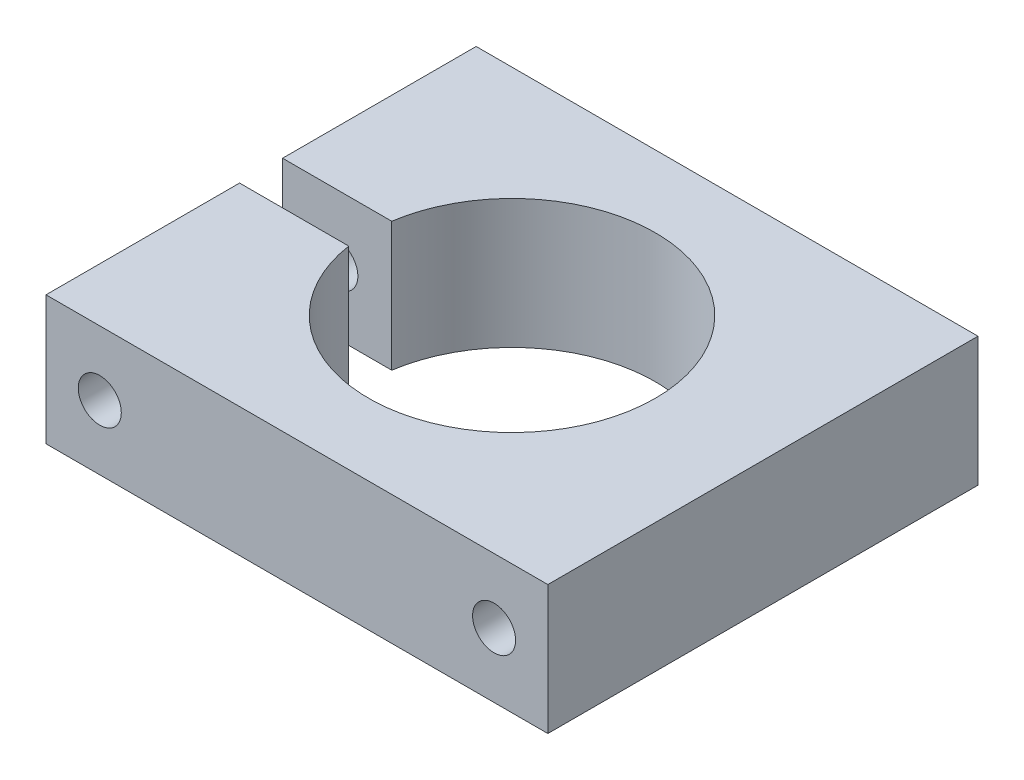
ISO-10303-21;
HEADER;
FILE_DESCRIPTION(('STEP AP214'),'2;1');
FILE_NAME('part.step','',(''),(''),'','','');
FILE_SCHEMA(('AUTOMOTIVE_DESIGN { 1 0 10303 214 1 1 1 1 }'));
ENDSEC;
DATA;
#1=APPLICATION_CONTEXT('core data for automotive mechanical design processes');
#2=APPLICATION_PROTOCOL_DEFINITION('international standard','automotive_design',2000,#1);
#3=PRODUCT_CONTEXT('',#1,'mechanical');
#4=PRODUCT('Part','Part','',(#3));
#5=PRODUCT_RELATED_PRODUCT_CATEGORY('part','',(#4));
#6=PRODUCT_DEFINITION_FORMATION('','',#4);
#7=PRODUCT_DEFINITION_CONTEXT('part definition',#1,'design');
#8=PRODUCT_DEFINITION('design','',#6,#7);
#9=PRODUCT_DEFINITION_SHAPE('','',#8);
#10=(LENGTH_UNIT() NAMED_UNIT(*) SI_UNIT(.MILLI.,.METRE.));
#11=(NAMED_UNIT(*) PLANE_ANGLE_UNIT() SI_UNIT($,.RADIAN.));
#12=(NAMED_UNIT(*) SI_UNIT($,.STERADIAN.) SOLID_ANGLE_UNIT());
#13=UNCERTAINTY_MEASURE_WITH_UNIT(LENGTH_MEASURE(1.E-05),#10,'distance_accuracy_value','');
#14=(GEOMETRIC_REPRESENTATION_CONTEXT(3) GLOBAL_UNCERTAINTY_ASSIGNED_CONTEXT((#13)) GLOBAL_UNIT_ASSIGNED_CONTEXT((#10,
#11,#12)) REPRESENTATION_CONTEXT('',''));
#15=CARTESIAN_POINT('',(0.,0.,0.));
#16=DIRECTION('',(0.,0.,1.));
#17=DIRECTION('',(1.,0.,0.));
#18=AXIS2_PLACEMENT_3D('',#15,#16,#17);
#19=CARTESIAN_POINT('',(35.,18.,-30.));
#20=DIRECTION('',(-1.,0.,0.));
#21=DIRECTION('',(0.,0.,1.));
#22=AXIS2_PLACEMENT_3D('',#19,#20,#21);
#23=PLANE('',#22);
#24=DIRECTION('',(0.,0.,-1.));
#25=VECTOR('',#24,1.);
#26=CARTESIAN_POINT('',(35.,0.,-30.));
#27=LINE('',#26,#25);
#28=CARTESIAN_POINT('',(35.,0.,30.));
#29=VERTEX_POINT('',#28);
#30=CARTESIAN_POINT('',(35.,0.,-30.));
#31=VERTEX_POINT('',#30);
#32=EDGE_CURVE('E131',#29,#31,#27,.T.);
#33=ORIENTED_EDGE('',*,*,#32,.T.);
#34=DIRECTION('',(0.,-1.,0.));
#35=VECTOR('',#34,1.);
#36=CARTESIAN_POINT('',(35.,18.,-30.));
#37=LINE('',#36,#35);
#38=CARTESIAN_POINT('',(35.,18.,-30.));
#39=VERTEX_POINT('',#38);
#40=EDGE_CURVE('E11',#39,#31,#37,.T.);
#41=ORIENTED_EDGE('',*,*,#40,.F.);
#42=DIRECTION('',(0.,0.,-1.));
#43=VECTOR('',#42,1.);
#44=CARTESIAN_POINT('',(35.,18.,-30.));
#45=LINE('',#44,#43);
#46=CARTESIAN_POINT('',(35.,18.,30.));
#47=VERTEX_POINT('',#46);
#48=EDGE_CURVE('E146',#47,#39,#45,.T.);
#49=ORIENTED_EDGE('',*,*,#48,.F.);
#50=DIRECTION('',(0.,-1.,0.));
#51=VECTOR('',#50,1.);
#52=CARTESIAN_POINT('',(35.,18.,30.));
#53=LINE('',#52,#51);
#54=EDGE_CURVE('E127',#47,#29,#53,.T.);
#55=ORIENTED_EDGE('',*,*,#54,.T.);
#56=EDGE_LOOP('',(#33,#41,#49,#55));
#57=FACE_BOUND('',#56,.T.);
#58=ADVANCED_FACE('F35',(#57),#23,.F.);
#59=CARTESIAN_POINT('',(-35.,18.,-30.));
#60=DIRECTION('',(0.,0.,1.));
#61=DIRECTION('',(1.,0.,0.));
#62=AXIS2_PLACEMENT_3D('',#59,#60,#61);
#63=PLANE('',#62);
#64=CARTESIAN_POINT('',(27.5,8.9999999999999,-30.));
#65=DIRECTION('',(0.,0.,1.));
#66=DIRECTION('',(1.,0.,0.));
#67=AXIS2_PLACEMENT_3D('',#64,#65,#66);
#68=CIRCLE('',#67,3.);
#69=CARTESIAN_POINT('',(30.5,8.9999999999999,-30.));
#70=VERTEX_POINT('',#69);
#71=EDGE_CURVE('E184',#70,#70,#68,.T.);
#72=ORIENTED_EDGE('',*,*,#71,.T.);
#73=EDGE_LOOP('',(#72));
#74=FACE_BOUND('',#73,.T.);
#75=CARTESIAN_POINT('',(-27.5,8.9999999999999,-30.));
#76=DIRECTION('',(0.,0.,1.));
#77=DIRECTION('',(-1.,0.,0.));
#78=AXIS2_PLACEMENT_3D('',#75,#76,#77);
#79=CIRCLE('',#78,3.);
#80=CARTESIAN_POINT('',(-30.5,8.9999999999999,-30.));
#81=VERTEX_POINT('',#80);
#82=EDGE_CURVE('E188',#81,#81,#79,.T.);
#83=ORIENTED_EDGE('',*,*,#82,.T.);
#84=EDGE_LOOP('',(#83));
#85=FACE_BOUND('',#84,.T.);
#86=DIRECTION('',(-1.,0.,0.));
#87=VECTOR('',#86,1.);
#88=CARTESIAN_POINT('',(-35.,0.,-30.));
#89=LINE('',#88,#87);
#90=CARTESIAN_POINT('',(-35.,0.,-30.));
#91=VERTEX_POINT('',#90);
#92=EDGE_CURVE('E134',#31,#91,#89,.T.);
#93=ORIENTED_EDGE('',*,*,#92,.T.);
#94=DIRECTION('',(0.,-1.,0.));
#95=VECTOR('',#94,1.);
#96=CARTESIAN_POINT('',(-35.,18.,-30.));
#97=LINE('',#96,#95);
#98=CARTESIAN_POINT('',(-35.,18.,-30.));
#99=VERTEX_POINT('',#98);
#100=EDGE_CURVE('E43',#99,#91,#97,.T.);
#101=ORIENTED_EDGE('',*,*,#100,.F.);
#102=DIRECTION('',(-1.,0.,0.));
#103=VECTOR('',#102,1.);
#104=CARTESIAN_POINT('',(-35.,18.,-30.));
#105=LINE('',#104,#103);
#106=EDGE_CURVE('E94',#39,#99,#105,.T.);
#107=ORIENTED_EDGE('',*,*,#106,.F.);
#108=ORIENTED_EDGE('',*,*,#40,.T.);
#109=EDGE_LOOP('',(#93,#101,#107,#108));
#110=FACE_BOUND('',#109,.T.);
#111=ADVANCED_FACE('F197',(#74,#85,#110),#63,.F.);
#112=CARTESIAN_POINT('',(-35.,18.,-30.));
#113=DIRECTION('',(1.,0.,0.));
#114=DIRECTION('',(0.,0.,-1.));
#115=AXIS2_PLACEMENT_3D('',#112,#113,#114);
#116=PLANE('',#115);
#117=DIRECTION('',(0.,0.,1.));
#118=VECTOR('',#117,1.);
#119=CARTESIAN_POINT('',(-35.,0.,-30.));
#120=LINE('',#119,#118);
#121=CARTESIAN_POINT('',(-35.,0.,-3.));
#122=VERTEX_POINT('',#121);
#123=EDGE_CURVE('E137',#91,#122,#120,.T.);
#124=ORIENTED_EDGE('',*,*,#123,.T.);
#125=DIRECTION('',(0.,-1.,0.));
#126=VECTOR('',#125,1.);
#127=CARTESIAN_POINT('',(-35.,18.,-3.));
#128=LINE('',#127,#126);
#129=CARTESIAN_POINT('',(-35.,18.,-3.));
#130=VERTEX_POINT('',#129);
#131=EDGE_CURVE('E153',#130,#122,#128,.T.);
#132=ORIENTED_EDGE('',*,*,#131,.F.);
#133=DIRECTION('',(0.,0.,1.));
#134=VECTOR('',#133,1.);
#135=CARTESIAN_POINT('',(-35.,18.,-30.));
#136=LINE('',#135,#134);
#137=EDGE_CURVE('E161',#99,#130,#136,.T.);
#138=ORIENTED_EDGE('',*,*,#137,.F.);
#139=ORIENTED_EDGE('',*,*,#100,.T.);
#140=EDGE_LOOP('',(#124,#132,#138,#139));
#141=FACE_BOUND('',#140,.T.);
#142=ADVANCED_FACE('F159',(#141),#116,.F.);
#143=CARTESIAN_POINT('',(-19.7737199332852,18.,-3.));
#144=DIRECTION('',(0.,0.,-1.));
#145=DIRECTION('',(-1.,0.,0.));
#146=AXIS2_PLACEMENT_3D('',#143,#144,#145);
#147=PLANE('',#146);
#148=CARTESIAN_POINT('',(-27.5,8.9999999999999,-3.));
#149=DIRECTION('',(0.,0.,-1.));
#150=DIRECTION('',(-1.,0.,0.));
#151=AXIS2_PLACEMENT_3D('',#148,#149,#150);
#152=CIRCLE('',#151,3.);
#153=CARTESIAN_POINT('',(-30.5,8.9999999999999,-3.));
#154=VERTEX_POINT('',#153);
#155=EDGE_CURVE('E135',#154,#154,#152,.T.);
#156=ORIENTED_EDGE('',*,*,#155,.T.);
#157=EDGE_LOOP('',(#156));
#158=FACE_BOUND('',#157,.T.);
#159=DIRECTION('',(1.,0.,0.));
#160=VECTOR('',#159,1.);
#161=CARTESIAN_POINT('',(-19.7737199332852,0.,-3.));
#162=LINE('',#161,#160);
#163=CARTESIAN_POINT('',(-19.7737199332852,0.,-3.00000000000001));
#164=VERTEX_POINT('',#163);
#165=EDGE_CURVE('E139',#122,#164,#162,.T.);
#166=ORIENTED_EDGE('',*,*,#165,.T.);
#167=DIRECTION('',(0.,-1.,0.));
#168=VECTOR('',#167,1.);
#169=CARTESIAN_POINT('',(-19.7737199332852,18.,-3.00000000000001));
#170=LINE('',#169,#168);
#171=CARTESIAN_POINT('',(-19.7737199332852,18.,-3.00000000000001));
#172=VERTEX_POINT('',#171);
#173=EDGE_CURVE('E150',#172,#164,#170,.T.);
#174=ORIENTED_EDGE('',*,*,#173,.F.);
#175=DIRECTION('',(1.,0.,0.));
#176=VECTOR('',#175,1.);
#177=CARTESIAN_POINT('',(-19.7737199332852,18.,-3.));
#178=LINE('',#177,#176);
#179=EDGE_CURVE('E173',#130,#172,#178,.T.);
#180=ORIENTED_EDGE('',*,*,#179,.F.);
#181=ORIENTED_EDGE('',*,*,#131,.T.);
#182=EDGE_LOOP('',(#166,#174,#180,#181));
#183=FACE_BOUND('',#182,.T.);
#184=ADVANCED_FACE('F169',(#158,#183),#147,.F.);
#185=CARTESIAN_POINT('',(0.,18.,0.));
#186=DIRECTION('',(0.,-1.,0.));
#187=DIRECTION('',(0.,0.,-1.));
#188=AXIS2_PLACEMENT_3D('',#185,#186,#187);
#189=CYLINDRICAL_SURFACE('',#188,20.);
#190=CARTESIAN_POINT('',(0.,0.,0.));
#191=DIRECTION('',(0.,-1.,0.));
#192=DIRECTION('',(0.,0.,1.));
#193=AXIS2_PLACEMENT_3D('',#190,#191,#192);
#194=CIRCLE('',#193,20.);
#195=CARTESIAN_POINT('',(-19.7737199332852,0.,3.));
#196=VERTEX_POINT('',#195);
#197=EDGE_CURVE('E141',#164,#196,#194,.T.);
#198=ORIENTED_EDGE('',*,*,#197,.T.);
#199=DIRECTION('',(0.,-1.,0.));
#200=VECTOR('',#199,1.);
#201=CARTESIAN_POINT('',(-19.7737199332852,18.,3.));
#202=LINE('',#201,#200);
#203=CARTESIAN_POINT('',(-19.7737199332852,18.,3.));
#204=VERTEX_POINT('',#203);
#205=EDGE_CURVE('E122',#204,#196,#202,.T.);
#206=ORIENTED_EDGE('',*,*,#205,.F.);
#207=CARTESIAN_POINT('',(0.,18.,0.));
#208=DIRECTION('',(0.,-1.,0.));
#209=DIRECTION('',(0.,0.,1.));
#210=AXIS2_PLACEMENT_3D('',#207,#208,#209);
#211=CIRCLE('',#210,20.);
#212=EDGE_CURVE('E113',#172,#204,#211,.T.);
#213=ORIENTED_EDGE('',*,*,#212,.F.);
#214=ORIENTED_EDGE('',*,*,#173,.T.);
#215=EDGE_LOOP('',(#198,#206,#213,#214));
#216=FACE_BOUND('',#215,.T.);
#217=ADVANCED_FACE('F172',(#216),#189,.F.);
#218=CARTESIAN_POINT('',(-19.7737199332852,18.,3.));
#219=DIRECTION('',(0.,0.,1.));
#220=DIRECTION('',(1.,0.,0.));
#221=AXIS2_PLACEMENT_3D('',#218,#219,#220);
#222=PLANE('',#221);
#223=CARTESIAN_POINT('',(-27.5,8.9999999999999,3.));
#224=DIRECTION('',(0.,0.,1.));
#225=DIRECTION('',(1.,0.,0.));
#226=AXIS2_PLACEMENT_3D('',#223,#224,#225);
#227=CIRCLE('',#226,3.);
#228=CARTESIAN_POINT('',(-24.5,8.9999999999999,3.));
#229=VERTEX_POINT('',#228);
#230=EDGE_CURVE('E181',#229,#229,#227,.T.);
#231=ORIENTED_EDGE('',*,*,#230,.T.);
#232=EDGE_LOOP('',(#231));
#233=FACE_BOUND('',#232,.T.);
#234=DIRECTION('',(-1.,0.,0.));
#235=VECTOR('',#234,1.);
#236=CARTESIAN_POINT('',(-19.7737199332852,0.,3.));
#237=LINE('',#236,#235);
#238=CARTESIAN_POINT('',(-35.,0.,3.));
#239=VERTEX_POINT('',#238);
#240=EDGE_CURVE('E121',#196,#239,#237,.T.);
#241=ORIENTED_EDGE('',*,*,#240,.T.);
#242=DIRECTION('',(0.,-1.,0.));
#243=VECTOR('',#242,1.);
#244=CARTESIAN_POINT('',(-35.,18.,3.));
#245=LINE('',#244,#243);
#246=CARTESIAN_POINT('',(-35.,18.,3.));
#247=VERTEX_POINT('',#246);
#248=EDGE_CURVE('E118',#247,#239,#245,.T.);
#249=ORIENTED_EDGE('',*,*,#248,.F.);
#250=DIRECTION('',(-1.,0.,0.));
#251=VECTOR('',#250,1.);
#252=CARTESIAN_POINT('',(-19.7737199332852,18.,3.));
#253=LINE('',#252,#251);
#254=EDGE_CURVE('E107',#204,#247,#253,.T.);
#255=ORIENTED_EDGE('',*,*,#254,.F.);
#256=ORIENTED_EDGE('',*,*,#205,.T.);
#257=EDGE_LOOP('',(#241,#249,#255,#256));
#258=FACE_BOUND('',#257,.T.);
#259=ADVANCED_FACE('F119',(#233,#258),#222,.F.);
#260=CARTESIAN_POINT('',(-35.,18.,3.));
#261=DIRECTION('',(1.,0.,0.));
#262=DIRECTION('',(0.,0.,-1.));
#263=AXIS2_PLACEMENT_3D('',#260,#261,#262);
#264=PLANE('',#263);
#265=DIRECTION('',(0.,0.,1.));
#266=VECTOR('',#265,1.);
#267=CARTESIAN_POINT('',(-35.,0.,3.));
#268=LINE('',#267,#266);
#269=CARTESIAN_POINT('',(-35.,0.,30.));
#270=VERTEX_POINT('',#269);
#271=EDGE_CURVE('E80',#239,#270,#268,.T.);
#272=ORIENTED_EDGE('',*,*,#271,.T.);
#273=DIRECTION('',(0.,-1.,0.));
#274=VECTOR('',#273,1.);
#275=CARTESIAN_POINT('',(-35.,18.,30.));
#276=LINE('',#275,#274);
#277=CARTESIAN_POINT('',(-35.,18.,30.));
#278=VERTEX_POINT('',#277);
#279=EDGE_CURVE('E123',#278,#270,#276,.T.);
#280=ORIENTED_EDGE('',*,*,#279,.F.);
#281=DIRECTION('',(0.,0.,1.));
#282=VECTOR('',#281,1.);
#283=CARTESIAN_POINT('',(-35.,18.,3.));
#284=LINE('',#283,#282);
#285=EDGE_CURVE('E111',#247,#278,#284,.T.);
#286=ORIENTED_EDGE('',*,*,#285,.F.);
#287=ORIENTED_EDGE('',*,*,#248,.T.);
#288=EDGE_LOOP('',(#272,#280,#286,#287));
#289=FACE_BOUND('',#288,.T.);
#290=ADVANCED_FACE('F125',(#289),#264,.F.);
#291=CARTESIAN_POINT('',(-35.,18.,30.));
#292=DIRECTION('',(0.,0.,-1.));
#293=DIRECTION('',(-1.,0.,0.));
#294=AXIS2_PLACEMENT_3D('',#291,#292,#293);
#295=PLANE('',#294);
#296=CARTESIAN_POINT('',(27.5,8.9999999999999,30.));
#297=DIRECTION('',(0.,0.,1.));
#298=DIRECTION('',(1.,0.,0.));
#299=AXIS2_PLACEMENT_3D('',#296,#297,#298);
#300=CIRCLE('',#299,3.);
#301=CARTESIAN_POINT('',(30.5,8.9999999999999,30.));
#302=VERTEX_POINT('',#301);
#303=EDGE_CURVE('E191',#302,#302,#300,.T.);
#304=ORIENTED_EDGE('',*,*,#303,.F.);
#305=EDGE_LOOP('',(#304));
#306=FACE_BOUND('',#305,.T.);
#307=CARTESIAN_POINT('',(-27.5,8.9999999999999,30.));
#308=DIRECTION('',(0.,0.,1.));
#309=DIRECTION('',(-1.,0.,0.));
#310=AXIS2_PLACEMENT_3D('',#307,#308,#309);
#311=CIRCLE('',#310,3.);
#312=CARTESIAN_POINT('',(-30.5,8.9999999999999,30.));
#313=VERTEX_POINT('',#312);
#314=EDGE_CURVE('E185',#313,#313,#311,.T.);
#315=ORIENTED_EDGE('',*,*,#314,.F.);
#316=EDGE_LOOP('',(#315));
#317=FACE_BOUND('',#316,.T.);
#318=DIRECTION('',(1.,0.,0.));
#319=VECTOR('',#318,1.);
#320=CARTESIAN_POINT('',(-35.,0.,30.));
#321=LINE('',#320,#319);
#322=EDGE_CURVE('E86',#270,#29,#321,.T.);
#323=ORIENTED_EDGE('',*,*,#322,.T.);
#324=ORIENTED_EDGE('',*,*,#54,.F.);
#325=DIRECTION('',(1.,0.,0.));
#326=VECTOR('',#325,1.);
#327=CARTESIAN_POINT('',(-35.,18.,30.));
#328=LINE('',#327,#326);
#329=EDGE_CURVE('E51',#278,#47,#328,.T.);
#330=ORIENTED_EDGE('',*,*,#329,.F.);
#331=ORIENTED_EDGE('',*,*,#279,.T.);
#332=EDGE_LOOP('',(#323,#324,#330,#331));
#333=FACE_BOUND('',#332,.T.);
#334=ADVANCED_FACE('F208',(#306,#317,#333),#295,.F.);
#335=CARTESIAN_POINT('',(0.,18.,0.));
#336=DIRECTION('',(0.,1.,0.));
#337=DIRECTION('',(0.,0.,1.));
#338=AXIS2_PLACEMENT_3D('',#335,#336,#337);
#339=PLANE('',#338);
#340=ORIENTED_EDGE('',*,*,#48,.T.);
#341=ORIENTED_EDGE('',*,*,#106,.T.);
#342=ORIENTED_EDGE('',*,*,#137,.T.);
#343=ORIENTED_EDGE('',*,*,#179,.T.);
#344=ORIENTED_EDGE('',*,*,#212,.T.);
#345=ORIENTED_EDGE('',*,*,#254,.T.);
#346=ORIENTED_EDGE('',*,*,#285,.T.);
#347=ORIENTED_EDGE('',*,*,#329,.T.);
#348=EDGE_LOOP('',(#340,#341,#342,#343,#344,#345,#346,#347));
#349=FACE_BOUND('',#348,.T.);
#350=ADVANCED_FACE('F109',(#349),#339,.T.);
#351=CARTESIAN_POINT('',(0.,0.,0.));
#352=DIRECTION('',(0.,1.,0.));
#353=DIRECTION('',(0.,0.,1.));
#354=AXIS2_PLACEMENT_3D('',#351,#352,#353);
#355=PLANE('',#354);
#356=ORIENTED_EDGE('',*,*,#32,.F.);
#357=ORIENTED_EDGE('',*,*,#322,.F.);
#358=ORIENTED_EDGE('',*,*,#271,.F.);
#359=ORIENTED_EDGE('',*,*,#240,.F.);
#360=ORIENTED_EDGE('',*,*,#197,.F.);
#361=ORIENTED_EDGE('',*,*,#165,.F.);
#362=ORIENTED_EDGE('',*,*,#123,.F.);
#363=ORIENTED_EDGE('',*,*,#92,.F.);
#364=EDGE_LOOP('',(#356,#357,#358,#359,#360,#361,#362,#363));
#365=FACE_BOUND('',#364,.T.);
#366=ADVANCED_FACE('F165',(#365),#355,.F.);
#367=CARTESIAN_POINT('',(-27.5,8.9999999999999,-30.));
#368=DIRECTION('',(0.,0.,1.));
#369=DIRECTION('',(1.,0.,0.));
#370=AXIS2_PLACEMENT_3D('',#367,#368,#369);
#371=CYLINDRICAL_SURFACE('',#370,3.);
#372=ORIENTED_EDGE('',*,*,#314,.T.);
#373=EDGE_LOOP('',(#372));
#374=FACE_BOUND('',#373,.T.);
#375=ORIENTED_EDGE('',*,*,#230,.F.);
#376=EDGE_LOOP('',(#375));
#377=FACE_BOUND('',#376,.T.);
#378=ADVANCED_FACE('F204',(#374,#377),#371,.F.);
#379=CARTESIAN_POINT('',(27.5,8.9999999999999,-30.));
#380=DIRECTION('',(0.,0.,1.));
#381=DIRECTION('',(1.,0.,0.));
#382=AXIS2_PLACEMENT_3D('',#379,#380,#381);
#383=CYLINDRICAL_SURFACE('',#382,3.);
#384=ORIENTED_EDGE('',*,*,#71,.F.);
#385=EDGE_LOOP('',(#384));
#386=FACE_BOUND('',#385,.T.);
#387=ORIENTED_EDGE('',*,*,#303,.T.);
#388=EDGE_LOOP('',(#387));
#389=FACE_BOUND('',#388,.T.);
#390=ADVANCED_FACE('F200',(#386,#389),#383,.F.);
#391=ORIENTED_EDGE('',*,*,#82,.F.);
#392=EDGE_LOOP('',(#391));
#393=FACE_BOUND('',#392,.T.);
#394=ORIENTED_EDGE('',*,*,#155,.F.);
#395=EDGE_LOOP('',(#394));
#396=FACE_BOUND('',#395,.T.);
#397=ADVANCED_FACE('F203',(#393,#396),#371,.F.);
#398=CLOSED_SHELL('',(#58,#111,#142,#184,#217,#259,#290,#334,#350,#366,#378,#390,#397));
#399=MANIFOLD_SOLID_BREP('B2',#398);
#400=ADVANCED_BREP_SHAPE_REPRESENTATION('',(#18,#399),#14);
#401=SHAPE_DEFINITION_REPRESENTATION(#9,#400);
ENDSEC;
END-ISO-10303-21;
